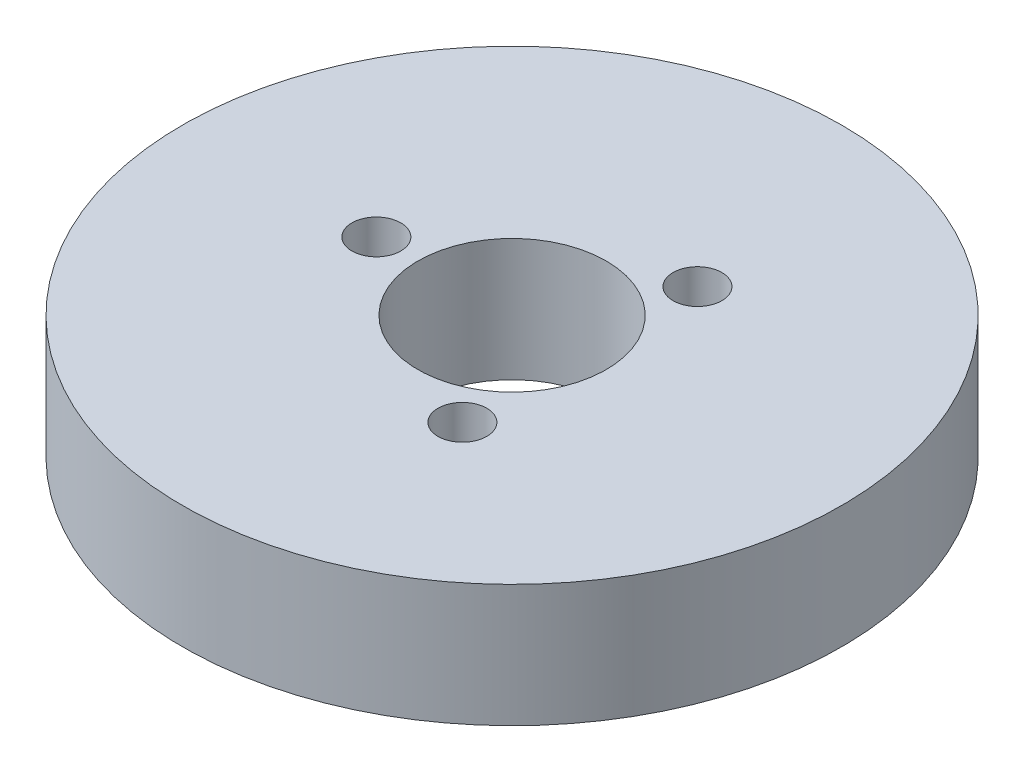
ISO-10303-21;
HEADER;
FILE_DESCRIPTION(('STEP AP214'),'2;1');
FILE_NAME('part.step','',(''),(''),'','','');
FILE_SCHEMA(('AUTOMOTIVE_DESIGN { 1 0 10303 214 1 1 1 1 }'));
ENDSEC;
DATA;
#1=APPLICATION_CONTEXT('core data for automotive mechanical design processes');
#2=APPLICATION_PROTOCOL_DEFINITION('international standard','automotive_design',2000,#1);
#3=PRODUCT_CONTEXT('',#1,'mechanical');
#4=PRODUCT('Part','Part','',(#3));
#5=PRODUCT_RELATED_PRODUCT_CATEGORY('part','',(#4));
#6=PRODUCT_DEFINITION_FORMATION('','',#4);
#7=PRODUCT_DEFINITION_CONTEXT('part definition',#1,'design');
#8=PRODUCT_DEFINITION('design','',#6,#7);
#9=PRODUCT_DEFINITION_SHAPE('','',#8);
#10=(LENGTH_UNIT() NAMED_UNIT(*) SI_UNIT(.MILLI.,.METRE.));
#11=(NAMED_UNIT(*) PLANE_ANGLE_UNIT() SI_UNIT($,.RADIAN.));
#12=(NAMED_UNIT(*) SI_UNIT($,.STERADIAN.) SOLID_ANGLE_UNIT());
#13=UNCERTAINTY_MEASURE_WITH_UNIT(LENGTH_MEASURE(1.E-05),#10,'distance_accuracy_value','');
#14=(GEOMETRIC_REPRESENTATION_CONTEXT(3) GLOBAL_UNCERTAINTY_ASSIGNED_CONTEXT((#13)) GLOBAL_UNIT_ASSIGNED_CONTEXT((#10,
#11,#12)) REPRESENTATION_CONTEXT('',''));
#15=CARTESIAN_POINT('',(0.,0.,0.));
#16=DIRECTION('',(0.,0.,1.));
#17=DIRECTION('',(1.,0.,0.));
#18=AXIS2_PLACEMENT_3D('',#15,#16,#17);
#19=CARTESIAN_POINT('',(0.,26.,0.));
#20=DIRECTION('',(0.,-1.,0.));
#21=DIRECTION('',(0.,0.,-1.));
#22=AXIS2_PLACEMENT_3D('',#19,#20,#21);
#23=CYLINDRICAL_SURFACE('',#22,70.);
#24=CARTESIAN_POINT('',(0.,26.,0.));
#25=DIRECTION('',(0.,1.,0.));
#26=DIRECTION('',(0.,0.,1.));
#27=AXIS2_PLACEMENT_3D('',#24,#25,#26);
#28=CIRCLE('',#27,70.);
#29=CARTESIAN_POINT('',(0.,26.,-70.));
#30=VERTEX_POINT('',#29);
#31=EDGE_CURVE('E10',#30,#30,#28,.T.);
#32=CARTESIAN_POINT('',(0.,0.,0.));
#33=DIRECTION('',(0.,1.,0.));
#34=DIRECTION('',(0.,0.,1.));
#35=AXIS2_PLACEMENT_3D('',#32,#33,#34);
#36=CIRCLE('',#35,70.);
#37=CARTESIAN_POINT('',(0.,0.,-70.));
#38=VERTEX_POINT('',#37);
#39=EDGE_CURVE('E37',#38,#38,#36,.T.);
#40=CARTESIAN_POINT('',(0.,26.,-70.));
#41=CARTESIAN_POINT('',(0.,25.7291666666667,-70.));
#42=CARTESIAN_POINT('',(0.,25.4583333333333,-70.));
#43=CARTESIAN_POINT('',(0.,24.9166666666667,-70.));
#44=CARTESIAN_POINT('',(0.,24.6458333333333,-70.));
#45=CARTESIAN_POINT('',(0.,24.1041666666667,-70.));
#46=CARTESIAN_POINT('',(0.,23.8333333333333,-70.));
#47=CARTESIAN_POINT('',(0.,23.2916666666667,-70.));
#48=CARTESIAN_POINT('',(0.,23.0208333333333,-70.));
#49=CARTESIAN_POINT('',(0.,22.4791666666667,-70.));
#50=CARTESIAN_POINT('',(0.,22.2083333333333,-70.));
#51=CARTESIAN_POINT('',(0.,21.6666666666667,-70.));
#52=CARTESIAN_POINT('',(0.,21.3958333333333,-70.));
#53=CARTESIAN_POINT('',(0.,20.8541666666667,-70.));
#54=CARTESIAN_POINT('',(0.,20.5833333333333,-70.));
#55=CARTESIAN_POINT('',(0.,20.0416666666667,-70.));
#56=CARTESIAN_POINT('',(0.,19.7708333333333,-70.));
#57=CARTESIAN_POINT('',(0.,19.2291666666667,-70.));
#58=CARTESIAN_POINT('',(0.,18.9583333333333,-70.));
#59=CARTESIAN_POINT('',(0.,18.4166666666667,-70.));
#60=CARTESIAN_POINT('',(0.,18.1458333333333,-70.));
#61=CARTESIAN_POINT('',(0.,17.6041666666667,-70.));
#62=CARTESIAN_POINT('',(0.,17.3333333333333,-70.));
#63=CARTESIAN_POINT('',(0.,16.7916666666667,-70.));
#64=CARTESIAN_POINT('',(0.,16.5208333333333,-70.));
#65=CARTESIAN_POINT('',(0.,15.9791666666667,-70.));
#66=CARTESIAN_POINT('',(0.,15.7083333333333,-70.));
#67=CARTESIAN_POINT('',(0.,15.1666666666667,-70.));
#68=CARTESIAN_POINT('',(0.,14.8958333333333,-70.));
#69=CARTESIAN_POINT('',(0.,14.3541666666667,-70.));
#70=CARTESIAN_POINT('',(0.,14.0833333333333,-70.));
#71=CARTESIAN_POINT('',(0.,13.5416666666667,-70.));
#72=CARTESIAN_POINT('',(0.,13.2708333333333,-70.));
#73=CARTESIAN_POINT('',(0.,12.7291666666667,-70.));
#74=CARTESIAN_POINT('',(0.,12.4583333333333,-70.));
#75=CARTESIAN_POINT('',(0.,11.9166666666667,-70.));
#76=CARTESIAN_POINT('',(0.,11.6458333333333,-70.));
#77=CARTESIAN_POINT('',(0.,11.1041666666667,-70.));
#78=CARTESIAN_POINT('',(0.,10.8333333333333,-70.));
#79=CARTESIAN_POINT('',(0.,10.2916666666667,-70.));
#80=CARTESIAN_POINT('',(0.,10.0208333333333,-70.));
#81=CARTESIAN_POINT('',(0.,9.47916666666667,-70.));
#82=CARTESIAN_POINT('',(0.,9.20833333333333,-70.));
#83=CARTESIAN_POINT('',(0.,8.66666666666667,-70.));
#84=CARTESIAN_POINT('',(0.,8.39583333333333,-70.));
#85=CARTESIAN_POINT('',(0.,7.85416666666667,-70.));
#86=CARTESIAN_POINT('',(0.,7.58333333333333,-70.));
#87=CARTESIAN_POINT('',(0.,7.04166666666667,-70.));
#88=CARTESIAN_POINT('',(0.,6.77083333333333,-70.));
#89=CARTESIAN_POINT('',(0.,6.22916666666667,-70.));
#90=CARTESIAN_POINT('',(0.,5.95833333333333,-70.));
#91=CARTESIAN_POINT('',(0.,5.41666666666667,-70.));
#92=CARTESIAN_POINT('',(0.,5.14583333333333,-70.));
#93=CARTESIAN_POINT('',(0.,4.60416666666667,-70.));
#94=CARTESIAN_POINT('',(0.,4.33333333333333,-70.));
#95=CARTESIAN_POINT('',(0.,3.79166666666667,-70.));
#96=CARTESIAN_POINT('',(0.,3.52083333333333,-70.));
#97=CARTESIAN_POINT('',(0.,2.97916666666667,-70.));
#98=CARTESIAN_POINT('',(0.,2.70833333333333,-70.));
#99=CARTESIAN_POINT('',(0.,2.16666666666667,-70.));
#100=CARTESIAN_POINT('',(0.,1.89583333333333,-70.));
#101=CARTESIAN_POINT('',(0.,1.35416666666667,-70.));
#102=CARTESIAN_POINT('',(0.,1.08333333333333,-70.));
#103=CARTESIAN_POINT('',(0.,0.541666666666667,-70.));
#104=CARTESIAN_POINT('',(0.,0.270833333333334,-70.));
#105=CARTESIAN_POINT('',(0.,0.,-70.));
#106=B_SPLINE_CURVE_WITH_KNOTS('',3,(#40,#41,#42,#43,#44,#45,#46,#47,#48,#49,#50,#51,#52,#53,
#54,#55,#56,#57,#58,#59,#60,#61,#62,#63,#64,#65,#66,#67,#68,#69,#70,#71,#72,#73,#74,#75,#76,#77,
#78,#79,#80,#81,#82,#83,#84,#85,#86,#87,#88,#89,#90,#91,#92,#93,#94,#95,#96,#97,#98,#99,#100,
#101,#102,#103,#104,#105),.UNSPECIFIED.,.F.,.F.,(4,2,2,2,2,2,2,2,2,2,2,2,2,2,2,2,2,2,2,2,2,2,2,
2,2,2,2,2,2,2,2,2,4),(0.,0.812500000000001,1.625,2.4375,3.25,4.0625,4.875,5.6875,6.5,7.3125,
8.125,8.9375,9.75,10.5625,11.375,12.1875,13.,13.8125,14.625,15.4375,16.25,17.0625,17.875,
18.6875,19.5,20.3125,21.125,21.9375,22.75,23.5625,24.375,25.1875,26.),.UNSPECIFIED.);
#107=EDGE_CURVE('BSEAM40',#30,#38,#106,.T.);
#108=ORIENTED_EDGE('',*,*,#31,.F.);
#109=ORIENTED_EDGE('',*,*,#39,.T.);
#110=ORIENTED_EDGE('',*,*,#107,.T.);
#111=ORIENTED_EDGE('',*,*,#107,.F.);
#112=EDGE_LOOP('',(#108,#110,#109,#111));
#113=FACE_BOUND('',#112,.T.);
#114=ADVANCED_FACE('F40',(#113),#23,.T.);
#115=CARTESIAN_POINT('',(0.,26.,0.));
#116=DIRECTION('',(0.,1.,0.));
#117=DIRECTION('',(0.,0.,1.));
#118=AXIS2_PLACEMENT_3D('',#115,#116,#117);
#119=PLANE('',#118);
#120=CARTESIAN_POINT('',(14.4123012710785,26.,24.9628380554973));
#121=DIRECTION('',(0.,1.,0.));
#122=DIRECTION('',(0.866025403784436,0.,-0.500000000000004));
#123=AXIS2_PLACEMENT_3D('',#120,#121,#122);
#124=CIRCLE('',#123,5.18657048109159);
#125=CARTESIAN_POINT('',(18.9040030662223,26.,22.3695528149514));
#126=VERTEX_POINT('',#125);
#127=EDGE_CURVE('E70',#126,#126,#124,.T.);
#128=ORIENTED_EDGE('',*,*,#127,.F.);
#129=EDGE_LOOP('',(#128));
#130=FACE_BOUND('',#129,.T.);
#131=CARTESIAN_POINT('',(14.4123012710782,26.,-24.9628380554975));
#132=DIRECTION('',(0.,1.,0.));
#133=DIRECTION('',(-0.866025403784443,0.,-0.499999999999992));
#134=AXIS2_PLACEMENT_3D('',#131,#132,#133);
#135=CIRCLE('',#134,5.18657048109159);
#136=CARTESIAN_POINT('',(9.92059947593436,26.,-27.5561232960432));
#137=VERTEX_POINT('',#136);
#138=EDGE_CURVE('E61',#137,#137,#135,.T.);
#139=ORIENTED_EDGE('',*,*,#138,.F.);
#140=EDGE_LOOP('',(#139));
#141=FACE_BOUND('',#140,.T.);
#142=CARTESIAN_POINT('',(-28.8246025421568,26.,0.));
#143=DIRECTION('',(0.,1.,0.));
#144=DIRECTION('',(0.,0.,1.));
#145=AXIS2_PLACEMENT_3D('',#142,#143,#144);
#146=CIRCLE('',#145,5.18657048109159);
#147=CARTESIAN_POINT('',(-28.8246025421568,26.,5.18657048109159));
#148=VERTEX_POINT('',#147);
#149=EDGE_CURVE('E54',#148,#148,#146,.T.);
#150=ORIENTED_EDGE('',*,*,#149,.F.);
#151=EDGE_LOOP('',(#150));
#152=FACE_BOUND('',#151,.T.);
#153=CARTESIAN_POINT('',(0.,26.,0.));
#154=DIRECTION('',(0.,1.,0.));
#155=DIRECTION('',(0.,0.,1.));
#156=AXIS2_PLACEMENT_3D('',#153,#154,#155);
#157=CIRCLE('',#156,20.);
#158=CARTESIAN_POINT('',(0.,26.,-20.));
#159=VERTEX_POINT('',#158);
#160=EDGE_CURVE('E50',#159,#159,#157,.T.);
#161=ORIENTED_EDGE('',*,*,#160,.F.);
#162=EDGE_LOOP('',(#161));
#163=FACE_BOUND('',#162,.T.);
#164=ORIENTED_EDGE('',*,*,#31,.T.);
#165=EDGE_LOOP('',(#164));
#166=FACE_BOUND('',#165,.T.);
#167=ADVANCED_FACE('F85',(#130,#141,#152,#163,#166),#119,.T.);
#168=CARTESIAN_POINT('',(0.,0.,0.));
#169=DIRECTION('',(0.,1.,0.));
#170=DIRECTION('',(0.,0.,1.));
#171=AXIS2_PLACEMENT_3D('',#168,#169,#170);
#172=PLANE('',#171);
#173=CARTESIAN_POINT('',(0.,0.,0.));
#174=DIRECTION('',(0.,1.,0.));
#175=DIRECTION('',(0.,0.,1.));
#176=AXIS2_PLACEMENT_3D('',#173,#174,#175);
#177=CIRCLE('',#176,20.);
#178=CARTESIAN_POINT('',(0.,0.,-20.));
#179=VERTEX_POINT('',#178);
#180=EDGE_CURVE('E47',#179,#179,#177,.T.);
#181=ORIENTED_EDGE('',*,*,#180,.T.);
#182=EDGE_LOOP('',(#181));
#183=FACE_BOUND('',#182,.T.);
#184=ORIENTED_EDGE('',*,*,#39,.F.);
#185=EDGE_LOOP('',(#184));
#186=FACE_BOUND('',#185,.T.);
#187=ADVANCED_FACE('F84',(#183,#186),#172,.F.);
#188=CARTESIAN_POINT('',(0.,26.,0.));
#189=DIRECTION('',(0.,-1.,0.));
#190=DIRECTION('',(0.,0.,-1.));
#191=AXIS2_PLACEMENT_3D('',#188,#189,#190);
#192=CYLINDRICAL_SURFACE('',#191,20.);
#193=CARTESIAN_POINT('',(0.,26.,-20.));
#194=CARTESIAN_POINT('',(0.,25.7291666666667,-20.));
#195=CARTESIAN_POINT('',(0.,25.4583333333333,-20.));
#196=CARTESIAN_POINT('',(0.,24.9166666666667,-20.));
#197=CARTESIAN_POINT('',(0.,24.6458333333333,-20.));
#198=CARTESIAN_POINT('',(0.,24.1041666666667,-20.));
#199=CARTESIAN_POINT('',(0.,23.8333333333333,-20.));
#200=CARTESIAN_POINT('',(0.,23.2916666666667,-20.));
#201=CARTESIAN_POINT('',(0.,23.0208333333333,-20.));
#202=CARTESIAN_POINT('',(0.,22.4791666666667,-20.));
#203=CARTESIAN_POINT('',(0.,22.2083333333333,-20.));
#204=CARTESIAN_POINT('',(0.,21.6666666666667,-20.));
#205=CARTESIAN_POINT('',(0.,21.3958333333333,-20.));
#206=CARTESIAN_POINT('',(0.,20.8541666666667,-20.));
#207=CARTESIAN_POINT('',(0.,20.5833333333333,-20.));
#208=CARTESIAN_POINT('',(0.,20.0416666666667,-20.));
#209=CARTESIAN_POINT('',(0.,19.7708333333333,-20.));
#210=CARTESIAN_POINT('',(0.,19.2291666666667,-20.));
#211=CARTESIAN_POINT('',(0.,18.9583333333333,-20.));
#212=CARTESIAN_POINT('',(0.,18.4166666666667,-20.));
#213=CARTESIAN_POINT('',(0.,18.1458333333333,-20.));
#214=CARTESIAN_POINT('',(0.,17.6041666666667,-20.));
#215=CARTESIAN_POINT('',(0.,17.3333333333333,-20.));
#216=CARTESIAN_POINT('',(0.,16.7916666666667,-20.));
#217=CARTESIAN_POINT('',(0.,16.5208333333333,-20.));
#218=CARTESIAN_POINT('',(0.,15.9791666666667,-20.));
#219=CARTESIAN_POINT('',(0.,15.7083333333333,-20.));
#220=CARTESIAN_POINT('',(0.,15.1666666666667,-20.));
#221=CARTESIAN_POINT('',(0.,14.8958333333333,-20.));
#222=CARTESIAN_POINT('',(0.,14.3541666666667,-20.));
#223=CARTESIAN_POINT('',(0.,14.0833333333333,-20.));
#224=CARTESIAN_POINT('',(0.,13.5416666666667,-20.));
#225=CARTESIAN_POINT('',(0.,13.2708333333333,-20.));
#226=CARTESIAN_POINT('',(0.,12.7291666666667,-20.));
#227=CARTESIAN_POINT('',(0.,12.4583333333333,-20.));
#228=CARTESIAN_POINT('',(0.,11.9166666666667,-20.));
#229=CARTESIAN_POINT('',(0.,11.6458333333333,-20.));
#230=CARTESIAN_POINT('',(0.,11.1041666666667,-20.));
#231=CARTESIAN_POINT('',(0.,10.8333333333333,-20.));
#232=CARTESIAN_POINT('',(0.,10.2916666666667,-20.));
#233=CARTESIAN_POINT('',(0.,10.0208333333333,-20.));
#234=CARTESIAN_POINT('',(0.,9.47916666666667,-20.));
#235=CARTESIAN_POINT('',(0.,9.20833333333333,-20.));
#236=CARTESIAN_POINT('',(0.,8.66666666666667,-20.));
#237=CARTESIAN_POINT('',(0.,8.39583333333333,-20.));
#238=CARTESIAN_POINT('',(0.,7.85416666666667,-20.));
#239=CARTESIAN_POINT('',(0.,7.58333333333333,-20.));
#240=CARTESIAN_POINT('',(0.,7.04166666666667,-20.));
#241=CARTESIAN_POINT('',(0.,6.77083333333333,-20.));
#242=CARTESIAN_POINT('',(0.,6.22916666666667,-20.));
#243=CARTESIAN_POINT('',(0.,5.95833333333333,-20.));
#244=CARTESIAN_POINT('',(0.,5.41666666666667,-20.));
#245=CARTESIAN_POINT('',(0.,5.14583333333333,-20.));
#246=CARTESIAN_POINT('',(0.,4.60416666666667,-20.));
#247=CARTESIAN_POINT('',(0.,4.33333333333333,-20.));
#248=CARTESIAN_POINT('',(0.,3.79166666666667,-20.));
#249=CARTESIAN_POINT('',(0.,3.52083333333333,-20.));
#250=CARTESIAN_POINT('',(0.,2.97916666666667,-20.));
#251=CARTESIAN_POINT('',(0.,2.70833333333333,-20.));
#252=CARTESIAN_POINT('',(0.,2.16666666666667,-20.));
#253=CARTESIAN_POINT('',(0.,1.89583333333333,-20.));
#254=CARTESIAN_POINT('',(0.,1.35416666666667,-20.));
#255=CARTESIAN_POINT('',(0.,1.08333333333333,-20.));
#256=CARTESIAN_POINT('',(0.,0.541666666666667,-20.));
#257=CARTESIAN_POINT('',(0.,0.270833333333334,-20.));
#258=CARTESIAN_POINT('',(0.,0.,-20.));
#259=B_SPLINE_CURVE_WITH_KNOTS('',3,(#193,#194,#195,#196,#197,#198,#199,#200,#201,#202,#203,
#204,#205,#206,#207,#208,#209,#210,#211,#212,#213,#214,#215,#216,#217,#218,#219,#220,#221,#222,
#223,#224,#225,#226,#227,#228,#229,#230,#231,#232,#233,#234,#235,#236,#237,#238,#239,#240,#241,
#242,#243,#244,#245,#246,#247,#248,#249,#250,#251,#252,#253,#254,#255,#256,#257,#258),
.UNSPECIFIED.,.F.,.F.,(4,2,2,2,2,2,2,2,2,2,2,2,2,2,2,2,2,2,2,2,2,2,2,2,2,2,2,2,2,2,2,2,4),(0.,
0.812500000000001,1.625,2.4375,3.25,4.0625,4.875,5.6875,6.5,7.3125,8.125,8.9375,9.75,10.5625,
11.375,12.1875,13.,13.8125,14.625,15.4375,16.25,17.0625,17.875,18.6875,19.5,20.3125,21.125,
21.9375,22.75,23.5625,24.375,25.1875,26.),.UNSPECIFIED.);
#260=EDGE_CURVE('BSEAM91',#159,#179,#259,.T.);
#261=ORIENTED_EDGE('',*,*,#160,.T.);
#262=ORIENTED_EDGE('',*,*,#180,.F.);
#263=ORIENTED_EDGE('',*,*,#260,.T.);
#264=ORIENTED_EDGE('',*,*,#260,.F.);
#265=EDGE_LOOP('',(#261,#263,#262,#264));
#266=FACE_BOUND('',#265,.T.);
#267=ADVANCED_FACE('F91',(#266),#192,.F.);
#268=CARTESIAN_POINT('',(-28.8246025421568,4.60095312146529,0.));
#269=DIRECTION('',(0.,1.,0.));
#270=DIRECTION('',(0.,0.,1.));
#271=AXIS2_PLACEMENT_3D('',#268,#269,#270);
#272=CYLINDRICAL_SURFACE('',#271,5.18657048109159);
#273=CARTESIAN_POINT('',(-28.8246025421568,4.60095312146529,0.));
#274=DIRECTION('',(0.,1.,0.));
#275=DIRECTION('',(0.,0.,1.));
#276=AXIS2_PLACEMENT_3D('',#273,#274,#275);
#277=CIRCLE('',#276,5.18657048109159);
#278=CARTESIAN_POINT('',(-28.8246025421568,4.60095312146529,5.18657048109159));
#279=VERTEX_POINT('',#278);
#280=EDGE_CURVE('E55',#279,#279,#277,.T.);
#281=ORIENTED_EDGE('',*,*,#280,.F.);
#282=EDGE_LOOP('',(#281));
#283=FACE_BOUND('',#282,.T.);
#284=ORIENTED_EDGE('',*,*,#149,.T.);
#285=EDGE_LOOP('',(#284));
#286=FACE_BOUND('',#285,.T.);
#287=ADVANCED_FACE('F96',(#283,#286),#272,.F.);
#288=CARTESIAN_POINT('',(-28.8246025421568,4.60095312146529,0.));
#289=DIRECTION('',(0.,1.,0.));
#290=DIRECTION('',(0.,0.,1.));
#291=AXIS2_PLACEMENT_3D('',#288,#289,#290);
#292=PLANE('',#291);
#293=ORIENTED_EDGE('',*,*,#280,.T.);
#294=EDGE_LOOP('',(#293));
#295=FACE_BOUND('',#294,.T.);
#296=ADVANCED_FACE('F127',(#295),#292,.T.);
#297=CARTESIAN_POINT('',(14.4123012710782,4.60095312146529,-24.9628380554975));
#298=DIRECTION('',(0.,1.,0.));
#299=DIRECTION('',(0.,0.,1.));
#300=AXIS2_PLACEMENT_3D('',#297,#298,#299);
#301=CYLINDRICAL_SURFACE('',#300,5.18657048109159);
#302=CARTESIAN_POINT('',(14.4123012710782,4.60095312146529,-24.9628380554975));
#303=DIRECTION('',(0.,1.,0.));
#304=DIRECTION('',(-0.866025403784443,0.,-0.499999999999992));
#305=AXIS2_PLACEMENT_3D('',#302,#303,#304);
#306=CIRCLE('',#305,5.18657048109159);
#307=CARTESIAN_POINT('',(9.92059947593436,4.60095312146529,-27.5561232960432));
#308=VERTEX_POINT('',#307);
#309=EDGE_CURVE('E63',#308,#308,#306,.T.);
#310=ORIENTED_EDGE('',*,*,#309,.F.);
#311=EDGE_LOOP('',(#310));
#312=FACE_BOUND('',#311,.T.);
#313=ORIENTED_EDGE('',*,*,#138,.T.);
#314=EDGE_LOOP('',(#313));
#315=FACE_BOUND('',#314,.T.);
#316=ADVANCED_FACE('F133',(#312,#315),#301,.F.);
#317=CARTESIAN_POINT('',(14.4123012710782,4.60095312146529,-24.9628380554975));
#318=DIRECTION('',(0.,1.,0.));
#319=DIRECTION('',(-0.866025403784443,0.,-0.499999999999992));
#320=AXIS2_PLACEMENT_3D('',#317,#318,#319);
#321=PLANE('',#320);
#322=ORIENTED_EDGE('',*,*,#309,.T.);
#323=EDGE_LOOP('',(#322));
#324=FACE_BOUND('',#323,.T.);
#325=ADVANCED_FACE('F77',(#324),#321,.T.);
#326=CARTESIAN_POINT('',(14.4123012710785,4.60095312146529,24.9628380554973));
#327=DIRECTION('',(0.,1.,0.));
#328=DIRECTION('',(0.,0.,1.));
#329=AXIS2_PLACEMENT_3D('',#326,#327,#328);
#330=CYLINDRICAL_SURFACE('',#329,5.18657048109159);
#331=CARTESIAN_POINT('',(14.4123012710785,4.60095312146529,24.9628380554973));
#332=DIRECTION('',(0.,1.,0.));
#333=DIRECTION('',(0.866025403784436,0.,-0.500000000000004));
#334=AXIS2_PLACEMENT_3D('',#331,#332,#333);
#335=CIRCLE('',#334,5.18657048109159);
#336=CARTESIAN_POINT('',(18.9040030662223,4.60095312146529,22.3695528149514));
#337=VERTEX_POINT('',#336);
#338=EDGE_CURVE('E59',#337,#337,#335,.T.);
#339=ORIENTED_EDGE('',*,*,#338,.F.);
#340=EDGE_LOOP('',(#339));
#341=FACE_BOUND('',#340,.T.);
#342=ORIENTED_EDGE('',*,*,#127,.T.);
#343=EDGE_LOOP('',(#342));
#344=FACE_BOUND('',#343,.T.);
#345=ADVANCED_FACE('F73',(#341,#344),#330,.F.);
#346=CARTESIAN_POINT('',(14.4123012710785,4.60095312146529,24.9628380554973));
#347=DIRECTION('',(0.,1.,0.));
#348=DIRECTION('',(0.866025403784436,0.,-0.500000000000004));
#349=AXIS2_PLACEMENT_3D('',#346,#347,#348);
#350=PLANE('',#349);
#351=ORIENTED_EDGE('',*,*,#338,.T.);
#352=EDGE_LOOP('',(#351));
#353=FACE_BOUND('',#352,.T.);
#354=ADVANCED_FACE('F71',(#353),#350,.T.);
#355=CLOSED_SHELL('',(#114,#167,#187,#267,#287,#296,#316,#325,#345,#354));
#356=MANIFOLD_SOLID_BREP('B2',#355);
#357=ADVANCED_BREP_SHAPE_REPRESENTATION('',(#18,#356),#14);
#358=SHAPE_DEFINITION_REPRESENTATION(#9,#357);
ENDSEC;
END-ISO-10303-21;
